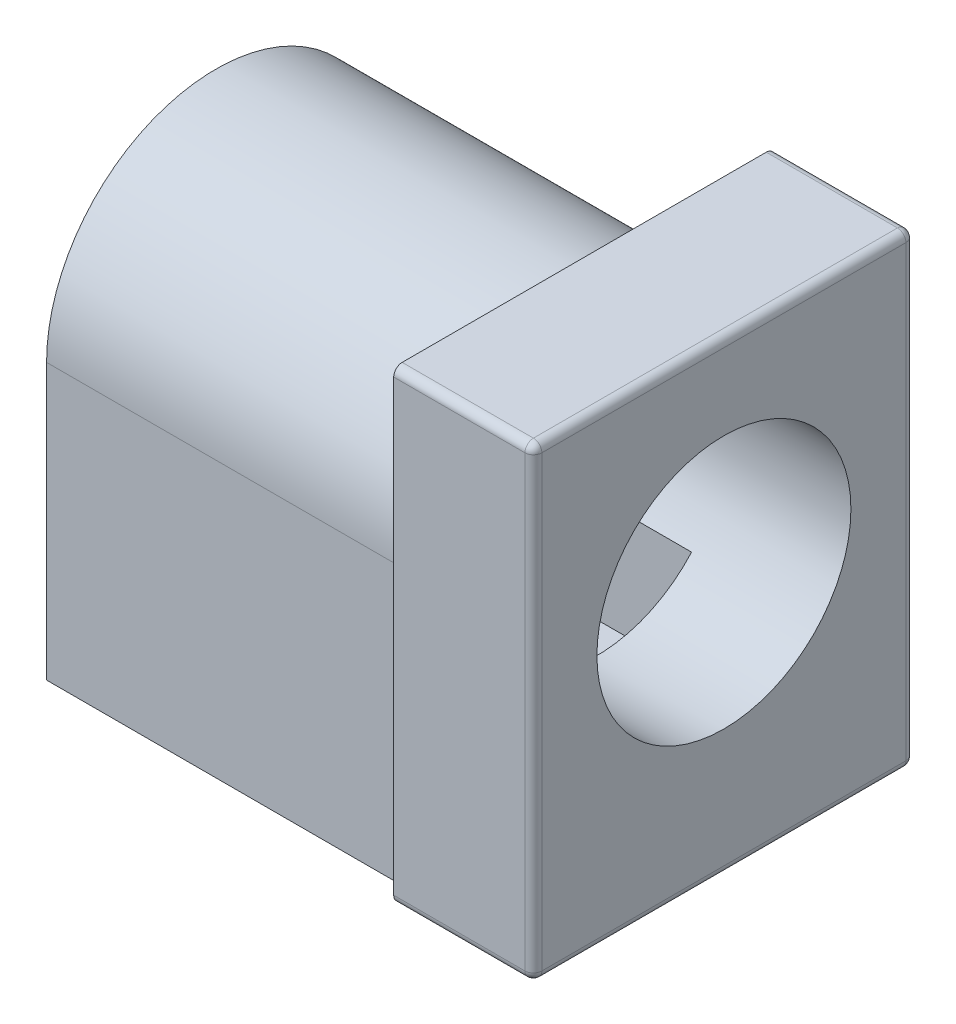
ISO-10303-21;
HEADER;
FILE_DESCRIPTION(('STEP AP214'),'2;1');
FILE_NAME('part.step','',(''),(''),'','','');
FILE_SCHEMA(('AUTOMOTIVE_DESIGN { 1 0 10303 214 1 1 1 1 }'));
ENDSEC;
DATA;
#1=APPLICATION_CONTEXT('core data for automotive mechanical design processes');
#2=APPLICATION_PROTOCOL_DEFINITION('international standard','automotive_design',2000,#1);
#3=PRODUCT_CONTEXT('',#1,'mechanical');
#4=PRODUCT('Part','Part','',(#3));
#5=PRODUCT_RELATED_PRODUCT_CATEGORY('part','',(#4));
#6=PRODUCT_DEFINITION_FORMATION('','',#4);
#7=PRODUCT_DEFINITION_CONTEXT('part definition',#1,'design');
#8=PRODUCT_DEFINITION('design','',#6,#7);
#9=PRODUCT_DEFINITION_SHAPE('','',#8);
#10=(LENGTH_UNIT() NAMED_UNIT(*) SI_UNIT(.MILLI.,.METRE.));
#11=(NAMED_UNIT(*) PLANE_ANGLE_UNIT() SI_UNIT($,.RADIAN.));
#12=(NAMED_UNIT(*) SI_UNIT($,.STERADIAN.) SOLID_ANGLE_UNIT());
#13=UNCERTAINTY_MEASURE_WITH_UNIT(LENGTH_MEASURE(1.E-05),#10,'distance_accuracy_value','');
#14=(GEOMETRIC_REPRESENTATION_CONTEXT(3) GLOBAL_UNCERTAINTY_ASSIGNED_CONTEXT((#13)) GLOBAL_UNIT_ASSIGNED_CONTEXT((#10,
#11,#12)) REPRESENTATION_CONTEXT('',''));
#15=CARTESIAN_POINT('',(0.,0.,0.));
#16=DIRECTION('',(0.,0.,1.));
#17=DIRECTION('',(1.,0.,0.));
#18=AXIS2_PLACEMENT_3D('',#15,#16,#17);
#19=CARTESIAN_POINT('',(12.,0.,0.));
#20=DIRECTION('',(0.,0.,-1.));
#21=DIRECTION('',(-1.,0.,0.));
#22=AXIS2_PLACEMENT_3D('',#19,#20,#21);
#23=PLANE('',#22);
#24=DIRECTION('',(0.,-1.,0.));
#25=VECTOR('',#24,1.);
#26=CARTESIAN_POINT('',(8.7,0.,0.));
#27=LINE('',#26,#25);
#28=CARTESIAN_POINT('',(8.7,10.8,0.));
#29=VERTEX_POINT('',#28);
#30=CARTESIAN_POINT('',(8.7,0.2,0.));
#31=VERTEX_POINT('',#30);
#32=EDGE_CURVE('E296',#29,#31,#27,.T.);
#33=ORIENTED_EDGE('',*,*,#32,.T.);
#34=DIRECTION('',(-1.,0.,0.));
#35=VECTOR('',#34,1.);
#36=CARTESIAN_POINT('',(12.,0.2,0.));
#37=LINE('',#36,#35);
#38=CARTESIAN_POINT('',(11.8,0.2,0.));
#39=VERTEX_POINT('',#38);
#40=EDGE_CURVE('E360',#31,#39,#37,.F.);
#41=ORIENTED_EDGE('',*,*,#40,.T.);
#42=DIRECTION('',(0.,-1.,0.));
#43=VECTOR('',#42,1.);
#44=CARTESIAN_POINT('',(11.8,0.,0.));
#45=LINE('',#44,#43);
#46=CARTESIAN_POINT('',(11.8,10.8,0.));
#47=VERTEX_POINT('',#46);
#48=EDGE_CURVE('E358',#39,#47,#45,.F.);
#49=ORIENTED_EDGE('',*,*,#48,.T.);
#50=DIRECTION('',(-1.,0.,0.));
#51=VECTOR('',#50,1.);
#52=CARTESIAN_POINT('',(12.,10.8,0.));
#53=LINE('',#52,#51);
#54=EDGE_CURVE('E356',#47,#29,#53,.T.);
#55=ORIENTED_EDGE('',*,*,#54,.T.);
#56=EDGE_LOOP('',(#33,#41,#49,#55));
#57=FACE_BOUND('',#56,.T.);
#58=ADVANCED_FACE('F35',(#57),#23,.F.);
#59=CARTESIAN_POINT('',(12.,0.,0.));
#60=DIRECTION('',(0.,1.,0.));
#61=DIRECTION('',(0.,0.,1.));
#62=AXIS2_PLACEMENT_3D('',#59,#60,#61);
#63=PLANE('',#62);
#64=DIRECTION('',(0.,0.,1.));
#65=VECTOR('',#64,1.);
#66=CARTESIAN_POINT('',(5.25,0.,-3.));
#67=LINE('',#66,#65);
#68=CARTESIAN_POINT('',(5.25,0.,-6.));
#69=VERTEX_POINT('',#68);
#70=CARTESIAN_POINT('',(5.25,0.,-3.));
#71=VERTEX_POINT('',#70);
#72=EDGE_CURVE('E275',#69,#71,#67,.T.);
#73=ORIENTED_EDGE('',*,*,#72,.F.);
#74=DIRECTION('',(1.,0.,0.));
#75=VECTOR('',#74,1.);
#76=CARTESIAN_POINT('',(4.75,0.,-6.));
#77=LINE('',#76,#75);
#78=CARTESIAN_POINT('',(4.75,0.,-6.));
#79=VERTEX_POINT('',#78);
#80=EDGE_CURVE('E278',#79,#69,#77,.T.);
#81=ORIENTED_EDGE('',*,*,#80,.F.);
#82=DIRECTION('',(0.,0.,-1.));
#83=VECTOR('',#82,1.);
#84=CARTESIAN_POINT('',(4.75,0.,-3.));
#85=LINE('',#84,#83);
#86=CARTESIAN_POINT('',(4.75,0.,-3.));
#87=VERTEX_POINT('',#86);
#88=EDGE_CURVE('E281',#87,#79,#85,.T.);
#89=ORIENTED_EDGE('',*,*,#88,.F.);
#90=DIRECTION('',(-1.,0.,0.));
#91=VECTOR('',#90,1.);
#92=CARTESIAN_POINT('',(4.75,0.,-3.));
#93=LINE('',#92,#91);
#94=EDGE_CURVE('E271',#71,#87,#93,.T.);
#95=ORIENTED_EDGE('',*,*,#94,.F.);
#96=EDGE_LOOP('',(#73,#81,#89,#95));
#97=FACE_BOUND('',#96,.T.);
#98=DIRECTION('',(0.,0.,-1.));
#99=VECTOR('',#98,1.);
#100=CARTESIAN_POINT('',(11.8,0.,0.));
#101=LINE('',#100,#99);
#102=CARTESIAN_POINT('',(11.8,0.,-8.8));
#103=VERTEX_POINT('',#102);
#104=CARTESIAN_POINT('',(11.8,0.,-0.2));
#105=VERTEX_POINT('',#104);
#106=EDGE_CURVE('E343',#103,#105,#101,.F.);
#107=ORIENTED_EDGE('',*,*,#106,.T.);
#108=DIRECTION('',(-1.,0.,0.));
#109=VECTOR('',#108,1.);
#110=CARTESIAN_POINT('',(12.,0.,-0.2));
#111=LINE('',#110,#109);
#112=CARTESIAN_POINT('',(8.7,0.,-0.2));
#113=VERTEX_POINT('',#112);
#114=EDGE_CURVE('E345',#105,#113,#111,.T.);
#115=ORIENTED_EDGE('',*,*,#114,.T.);
#116=DIRECTION('',(0.,0.,-1.));
#117=VECTOR('',#116,1.);
#118=CARTESIAN_POINT('',(8.7,0.,0.));
#119=LINE('',#118,#117);
#120=CARTESIAN_POINT('',(8.7,0.,-0.499999999999999));
#121=VERTEX_POINT('',#120);
#122=EDGE_CURVE('E310',#113,#121,#119,.T.);
#123=ORIENTED_EDGE('',*,*,#122,.T.);
#124=DIRECTION('',(1.,0.,0.));
#125=VECTOR('',#124,1.);
#126=CARTESIAN_POINT('',(-23.2513440471728,0.,-0.499999999999997));
#127=LINE('',#126,#125);
#128=CARTESIAN_POINT('',(0.,0.,-0.499999999999997));
#129=VERTEX_POINT('',#128);
#130=EDGE_CURVE('E314',#129,#121,#127,.T.);
#131=ORIENTED_EDGE('',*,*,#130,.F.);
#132=DIRECTION('',(0.,0.,-1.));
#133=VECTOR('',#132,1.);
#134=CARTESIAN_POINT('',(0.,0.,0.));
#135=LINE('',#134,#133);
#136=CARTESIAN_POINT('',(0.,0.,-8.5));
#137=VERTEX_POINT('',#136);
#138=EDGE_CURVE('E305',#129,#137,#135,.T.);
#139=ORIENTED_EDGE('',*,*,#138,.T.);
#140=DIRECTION('',(1.,0.,0.));
#141=VECTOR('',#140,1.);
#142=CARTESIAN_POINT('',(-23.2513440471728,0.,-8.5));
#143=LINE('',#142,#141);
#144=CARTESIAN_POINT('',(8.7,0.,-8.5));
#145=VERTEX_POINT('',#144);
#146=EDGE_CURVE('E323',#137,#145,#143,.T.);
#147=ORIENTED_EDGE('',*,*,#146,.T.);
#148=CARTESIAN_POINT('',(8.7,0.,-8.8));
#149=VERTEX_POINT('',#148);
#150=EDGE_CURVE('E337',#145,#149,#119,.T.);
#151=ORIENTED_EDGE('',*,*,#150,.T.);
#152=DIRECTION('',(-1.,0.,0.));
#153=VECTOR('',#152,1.);
#154=CARTESIAN_POINT('',(12.,0.,-8.8));
#155=LINE('',#154,#153);
#156=EDGE_CURVE('E341',#149,#103,#155,.F.);
#157=ORIENTED_EDGE('',*,*,#156,.T.);
#158=EDGE_LOOP('',(#107,#115,#123,#131,#139,#147,#151,#157));
#159=FACE_BOUND('',#158,.T.);
#160=ADVANCED_FACE('F429',(#97,#159),#63,.F.);
#161=CARTESIAN_POINT('',(12.,0.,-9.));
#162=DIRECTION('',(0.,0.,1.));
#163=DIRECTION('',(1.,0.,0.));
#164=AXIS2_PLACEMENT_3D('',#161,#162,#163);
#165=PLANE('',#164);
#166=DIRECTION('',(0.,1.,0.));
#167=VECTOR('',#166,1.);
#168=CARTESIAN_POINT('',(11.8,0.,-9.));
#169=LINE('',#168,#167);
#170=CARTESIAN_POINT('',(11.8,10.8,-9.));
#171=VERTEX_POINT('',#170);
#172=CARTESIAN_POINT('',(11.8,0.2,-9.));
#173=VERTEX_POINT('',#172);
#174=EDGE_CURVE('E373',#171,#173,#169,.F.);
#175=ORIENTED_EDGE('',*,*,#174,.T.);
#176=DIRECTION('',(-1.,0.,0.));
#177=VECTOR('',#176,1.);
#178=CARTESIAN_POINT('',(12.,0.2,-9.));
#179=LINE('',#178,#177);
#180=CARTESIAN_POINT('',(8.7,0.2,-9.));
#181=VERTEX_POINT('',#180);
#182=EDGE_CURVE('E375',#173,#181,#179,.T.);
#183=ORIENTED_EDGE('',*,*,#182,.T.);
#184=DIRECTION('',(0.,1.,0.));
#185=VECTOR('',#184,1.);
#186=CARTESIAN_POINT('',(8.7,0.,-9.));
#187=LINE('',#186,#185);
#188=CARTESIAN_POINT('',(8.7,10.8,-9.));
#189=VERTEX_POINT('',#188);
#190=EDGE_CURVE('E334',#181,#189,#187,.T.);
#191=ORIENTED_EDGE('',*,*,#190,.T.);
#192=DIRECTION('',(-1.,0.,0.));
#193=VECTOR('',#192,1.);
#194=CARTESIAN_POINT('',(12.,10.8,-9.));
#195=LINE('',#194,#193);
#196=EDGE_CURVE('E371',#189,#171,#195,.F.);
#197=ORIENTED_EDGE('',*,*,#196,.T.);
#198=EDGE_LOOP('',(#175,#183,#191,#197));
#199=FACE_BOUND('',#198,.T.);
#200=ADVANCED_FACE('F451',(#199),#165,.F.);
#201=CARTESIAN_POINT('',(12.,11.,0.));
#202=DIRECTION('',(0.,-1.,0.));
#203=DIRECTION('',(0.,0.,-1.));
#204=AXIS2_PLACEMENT_3D('',#201,#202,#203);
#205=PLANE('',#204);
#206=DIRECTION('',(0.,0.,1.));
#207=VECTOR('',#206,1.);
#208=CARTESIAN_POINT('',(11.8,11.,0.));
#209=LINE('',#208,#207);
#210=CARTESIAN_POINT('',(11.8,11.,-0.2));
#211=VERTEX_POINT('',#210);
#212=CARTESIAN_POINT('',(11.8,11.,-8.8));
#213=VERTEX_POINT('',#212);
#214=EDGE_CURVE('E58',#211,#213,#209,.F.);
#215=ORIENTED_EDGE('',*,*,#214,.T.);
#216=DIRECTION('',(-1.,0.,0.));
#217=VECTOR('',#216,1.);
#218=CARTESIAN_POINT('',(12.,11.,-8.8));
#219=LINE('',#218,#217);
#220=CARTESIAN_POINT('',(8.7,11.,-8.8));
#221=VERTEX_POINT('',#220);
#222=EDGE_CURVE('E380',#213,#221,#219,.T.);
#223=ORIENTED_EDGE('',*,*,#222,.T.);
#224=DIRECTION('',(0.,0.,1.));
#225=VECTOR('',#224,1.);
#226=CARTESIAN_POINT('',(8.7,11.,0.));
#227=LINE('',#226,#225);
#228=CARTESIAN_POINT('',(8.7,11.,-0.2));
#229=VERTEX_POINT('',#228);
#230=EDGE_CURVE('E331',#221,#229,#227,.T.);
#231=ORIENTED_EDGE('',*,*,#230,.T.);
#232=DIRECTION('',(-1.,0.,0.));
#233=VECTOR('',#232,1.);
#234=CARTESIAN_POINT('',(12.,11.,-0.2));
#235=LINE('',#234,#233);
#236=EDGE_CURVE('E377',#229,#211,#235,.F.);
#237=ORIENTED_EDGE('',*,*,#236,.T.);
#238=EDGE_LOOP('',(#215,#223,#231,#237));
#239=FACE_BOUND('',#238,.T.);
#240=ADVANCED_FACE('F746',(#239),#205,.F.);
#241=CARTESIAN_POINT('',(0.,0.,0.));
#242=DIRECTION('',(-1.,0.,0.));
#243=DIRECTION('',(0.,0.,1.));
#244=AXIS2_PLACEMENT_3D('',#241,#242,#243);
#245=PLANE('',#244);
#246=DIRECTION('',(0.,-1.,0.));
#247=VECTOR('',#246,1.);
#248=CARTESIAN_POINT('',(0.,4.,-6.73606797749979));
#249=LINE('',#248,#247);
#250=CARTESIAN_POINT('',(0.,3.5,-6.73606797749979));
#251=VERTEX_POINT('',#250);
#252=CARTESIAN_POINT('',(0.,1.5,-6.73606797749979));
#253=VERTEX_POINT('',#252);
#254=EDGE_CURVE('E211',#251,#253,#249,.T.);
#255=ORIENTED_EDGE('',*,*,#254,.F.);
#256=DIRECTION('',(0.,0.,-1.));
#257=VECTOR('',#256,1.);
#258=CARTESIAN_POINT('',(0.,3.5,0.001000000000001));
#259=LINE('',#258,#257);
#260=CARTESIAN_POINT('',(0.,3.5,-8.5));
#261=VERTEX_POINT('',#260);
#262=EDGE_CURVE('E268',#251,#261,#259,.T.);
#263=ORIENTED_EDGE('',*,*,#262,.T.);
#264=DIRECTION('',(0.,1.,0.));
#265=VECTOR('',#264,1.);
#266=CARTESIAN_POINT('',(0.,6.5,-8.5));
#267=LINE('',#266,#265);
#268=EDGE_CURVE('E303',#137,#261,#267,.T.);
#269=ORIENTED_EDGE('',*,*,#268,.F.);
#270=ORIENTED_EDGE('',*,*,#138,.F.);
#271=DIRECTION('',(0.,-1.,0.));
#272=VECTOR('',#271,1.);
#273=CARTESIAN_POINT('',(0.,6.5,-0.500000000000006));
#274=LINE('',#273,#272);
#275=CARTESIAN_POINT('',(0.,6.5,-0.500000000000006));
#276=VERTEX_POINT('',#275);
#277=EDGE_CURVE('E302',#276,#129,#274,.T.);
#278=ORIENTED_EDGE('',*,*,#277,.F.);
#279=CARTESIAN_POINT('',(0.,6.5,-4.5));
#280=DIRECTION('',(-1.,0.,0.));
#281=DIRECTION('',(0.,0.,1.));
#282=AXIS2_PLACEMENT_3D('',#279,#280,#281);
#283=CIRCLE('',#282,4.);
#284=CARTESIAN_POINT('',(0.,6.5,-8.5));
#285=VERTEX_POINT('',#284);
#286=EDGE_CURVE('E299',#285,#276,#283,.F.);
#287=ORIENTED_EDGE('',*,*,#286,.F.);
#288=CARTESIAN_POINT('',(0.,4.,-8.5));
#289=VERTEX_POINT('',#288);
#290=EDGE_CURVE('E326',#289,#285,#267,.T.);
#291=ORIENTED_EDGE('',*,*,#290,.F.);
#292=DIRECTION('',(0.,0.,-1.));
#293=VECTOR('',#292,1.);
#294=CARTESIAN_POINT('',(0.,4.,0.001000000000001));
#295=LINE('',#294,#293);
#296=CARTESIAN_POINT('',(0.,4.,-6.73606797749979));
#297=VERTEX_POINT('',#296);
#298=EDGE_CURVE('E266',#297,#289,#295,.T.);
#299=ORIENTED_EDGE('',*,*,#298,.F.);
#300=CARTESIAN_POINT('',(0.,6.,-4.5));
#301=DIRECTION('',(1.,0.,0.));
#302=DIRECTION('',(0.,0.,-1.));
#303=AXIS2_PLACEMENT_3D('',#300,#301,#302);
#304=CIRCLE('',#303,3.);
#305=CARTESIAN_POINT('',(0.,4.,-2.26393202250021));
#306=VERTEX_POINT('',#305);
#307=EDGE_CURVE('E293',#297,#306,#304,.T.);
#308=ORIENTED_EDGE('',*,*,#307,.T.);
#309=DIRECTION('',(0.,1.,0.));
#310=VECTOR('',#309,1.);
#311=CARTESIAN_POINT('',(0.,4.,-2.26393202250021));
#312=LINE('',#311,#310);
#313=CARTESIAN_POINT('',(0.,1.5,-2.26393202250021));
#314=VERTEX_POINT('',#313);
#315=EDGE_CURVE('E227',#314,#306,#312,.T.);
#316=ORIENTED_EDGE('',*,*,#315,.F.);
#317=DIRECTION('',(0.,0.,1.));
#318=VECTOR('',#317,1.);
#319=CARTESIAN_POINT('',(0.,1.5,-6.73606797749979));
#320=LINE('',#319,#318);
#321=EDGE_CURVE('E229',#253,#314,#320,.T.);
#322=ORIENTED_EDGE('',*,*,#321,.F.);
#323=EDGE_LOOP('',(#255,#263,#269,#270,#278,#287,#291,#299,#308,#316,#322));
#324=FACE_BOUND('',#323,.T.);
#325=ADVANCED_FACE('F530',(#324),#245,.T.);
#326=CARTESIAN_POINT('',(12.,0.,0.));
#327=DIRECTION('',(-1.,0.,0.));
#328=DIRECTION('',(0.,0.,1.));
#329=AXIS2_PLACEMENT_3D('',#326,#327,#328);
#330=PLANE('',#329);
#331=DIRECTION('',(0.,0.,1.));
#332=VECTOR('',#331,1.);
#333=CARTESIAN_POINT('',(12.,10.8,0.));
#334=LINE('',#333,#332);
#335=CARTESIAN_POINT('',(12.,10.8,-8.8));
#336=VERTEX_POINT('',#335);
#337=CARTESIAN_POINT('',(12.,10.8,-0.2));
#338=VERTEX_POINT('',#337);
#339=EDGE_CURVE('E364',#336,#338,#334,.T.);
#340=ORIENTED_EDGE('',*,*,#339,.T.);
#341=DIRECTION('',(0.,-1.,0.));
#342=VECTOR('',#341,1.);
#343=CARTESIAN_POINT('',(12.,0.,-0.2));
#344=LINE('',#343,#342);
#345=CARTESIAN_POINT('',(12.,0.2,-0.2));
#346=VERTEX_POINT('',#345);
#347=EDGE_CURVE('E368',#338,#346,#344,.T.);
#348=ORIENTED_EDGE('',*,*,#347,.T.);
#349=DIRECTION('',(0.,0.,-1.));
#350=VECTOR('',#349,1.);
#351=CARTESIAN_POINT('',(12.,0.2,0.));
#352=LINE('',#351,#350);
#353=CARTESIAN_POINT('',(12.,0.2,-8.8));
#354=VERTEX_POINT('',#353);
#355=EDGE_CURVE('E366',#346,#354,#352,.T.);
#356=ORIENTED_EDGE('',*,*,#355,.T.);
#357=DIRECTION('',(0.,1.,0.));
#358=VECTOR('',#357,1.);
#359=CARTESIAN_POINT('',(12.,0.,-8.8));
#360=LINE('',#359,#358);
#361=EDGE_CURVE('E362',#354,#336,#360,.T.);
#362=ORIENTED_EDGE('',*,*,#361,.T.);
#363=EDGE_LOOP('',(#340,#348,#356,#362));
#364=FACE_BOUND('',#363,.T.);
#365=CARTESIAN_POINT('',(12.,6.,-4.5));
#366=DIRECTION('',(1.,0.,0.));
#367=DIRECTION('',(0.,0.,-1.));
#368=AXIS2_PLACEMENT_3D('',#365,#366,#367);
#369=CIRCLE('',#368,3.);
#370=CARTESIAN_POINT('',(12.,6.,-7.5));
#371=VERTEX_POINT('',#370);
#372=EDGE_CURVE('E292',#371,#371,#369,.T.);
#373=ORIENTED_EDGE('',*,*,#372,.F.);
#374=EDGE_LOOP('',(#373));
#375=FACE_BOUND('',#374,.T.);
#376=ADVANCED_FACE('F728',(#364,#375),#330,.F.);
#377=CARTESIAN_POINT('',(-23.2513440471728,6.5,-8.5));
#378=DIRECTION('',(0.,0.,-1.));
#379=DIRECTION('',(0.,1.,0.));
#380=AXIS2_PLACEMENT_3D('',#377,#378,#379);
#381=PLANE('',#380);
#382=DIRECTION('',(1.,0.,0.));
#383=VECTOR('',#382,1.);
#384=CARTESIAN_POINT('',(3.,4.,-8.5));
#385=LINE('',#384,#383);
#386=CARTESIAN_POINT('',(3.,4.,-8.5));
#387=VERTEX_POINT('',#386);
#388=EDGE_CURVE('E259',#289,#387,#385,.T.);
#389=ORIENTED_EDGE('',*,*,#388,.F.);
#390=ORIENTED_EDGE('',*,*,#290,.T.);
#391=DIRECTION('',(1.,0.,0.));
#392=VECTOR('',#391,1.);
#393=CARTESIAN_POINT('',(-23.2513440471728,6.5,-8.5));
#394=LINE('',#393,#392);
#395=CARTESIAN_POINT('',(8.7,6.5,-8.5));
#396=VERTEX_POINT('',#395);
#397=EDGE_CURVE('E320',#285,#396,#394,.T.);
#398=ORIENTED_EDGE('',*,*,#397,.T.);
#399=DIRECTION('',(0.,1.,0.));
#400=VECTOR('',#399,1.);
#401=CARTESIAN_POINT('',(8.7,6.5,-8.5));
#402=LINE('',#401,#400);
#403=EDGE_CURVE('E312',#145,#396,#402,.T.);
#404=ORIENTED_EDGE('',*,*,#403,.F.);
#405=ORIENTED_EDGE('',*,*,#146,.F.);
#406=ORIENTED_EDGE('',*,*,#268,.T.);
#407=DIRECTION('',(-1.,0.,0.));
#408=VECTOR('',#407,1.);
#409=CARTESIAN_POINT('',(3.,3.5,-8.5));
#410=LINE('',#409,#408);
#411=CARTESIAN_POINT('',(3.,3.5,-8.5));
#412=VERTEX_POINT('',#411);
#413=EDGE_CURVE('E256',#412,#261,#410,.T.);
#414=ORIENTED_EDGE('',*,*,#413,.F.);
#415=DIRECTION('',(0.,-1.,0.));
#416=VECTOR('',#415,1.);
#417=CARTESIAN_POINT('',(3.,4.,-8.5));
#418=LINE('',#417,#416);
#419=EDGE_CURVE('E253',#387,#412,#418,.T.);
#420=ORIENTED_EDGE('',*,*,#419,.F.);
#421=EDGE_LOOP('',(#389,#390,#398,#404,#405,#406,#414,#420));
#422=FACE_BOUND('',#421,.T.);
#423=ADVANCED_FACE('F527',(#422),#381,.T.);
#424=CARTESIAN_POINT('',(-23.2513440471728,6.5,-4.5));
#425=DIRECTION('',(1.,0.,0.));
#426=DIRECTION('',(0.,0.,-1.));
#427=AXIS2_PLACEMENT_3D('',#424,#425,#426);
#428=CYLINDRICAL_SURFACE('',#427,4.);
#429=ORIENTED_EDGE('',*,*,#397,.F.);
#430=ORIENTED_EDGE('',*,*,#286,.T.);
#431=DIRECTION('',(1.,0.,0.));
#432=VECTOR('',#431,1.);
#433=CARTESIAN_POINT('',(-23.2513440471728,6.5,-0.500000000000006));
#434=LINE('',#433,#432);
#435=CARTESIAN_POINT('',(8.7,6.5,-0.500000000000006));
#436=VERTEX_POINT('',#435);
#437=EDGE_CURVE('E317',#276,#436,#434,.T.);
#438=ORIENTED_EDGE('',*,*,#437,.T.);
#439=CARTESIAN_POINT('',(8.7,6.5,-4.5));
#440=DIRECTION('',(-1.,0.,0.));
#441=DIRECTION('',(0.,0.,1.));
#442=AXIS2_PLACEMENT_3D('',#439,#440,#441);
#443=CIRCLE('',#442,4.);
#444=EDGE_CURVE('E309',#396,#436,#443,.F.);
#445=ORIENTED_EDGE('',*,*,#444,.F.);
#446=EDGE_LOOP('',(#429,#430,#438,#445));
#447=FACE_BOUND('',#446,.T.);
#448=ADVANCED_FACE('F712',(#447),#428,.T.);
#449=CARTESIAN_POINT('',(-23.2513440471728,6.5,-0.500000000000006));
#450=DIRECTION('',(0.,0.,1.));
#451=DIRECTION('',(0.,-1.,0.));
#452=AXIS2_PLACEMENT_3D('',#449,#450,#451);
#453=PLANE('',#452);
#454=ORIENTED_EDGE('',*,*,#437,.F.);
#455=ORIENTED_EDGE('',*,*,#277,.T.);
#456=ORIENTED_EDGE('',*,*,#130,.T.);
#457=DIRECTION('',(0.,-1.,0.));
#458=VECTOR('',#457,1.);
#459=CARTESIAN_POINT('',(8.7,6.5,-0.500000000000006));
#460=LINE('',#459,#458);
#461=EDGE_CURVE('E306',#436,#121,#460,.T.);
#462=ORIENTED_EDGE('',*,*,#461,.F.);
#463=EDGE_LOOP('',(#454,#455,#456,#462));
#464=FACE_BOUND('',#463,.T.);
#465=ADVANCED_FACE('F703',(#464),#453,.T.);
#466=CARTESIAN_POINT('',(8.7,0.,0.));
#467=DIRECTION('',(-1.,0.,0.));
#468=DIRECTION('',(0.,0.,1.));
#469=AXIS2_PLACEMENT_3D('',#466,#467,#468);
#470=PLANE('',#469);
#471=ORIENTED_EDGE('',*,*,#122,.F.);
#472=CARTESIAN_POINT('',(8.7,0.2,-0.2));
#473=DIRECTION('',(-1.,0.,0.));
#474=DIRECTION('',(0.,0.,1.));
#475=AXIS2_PLACEMENT_3D('',#472,#473,#474);
#476=CIRCLE('',#475,0.2);
#477=EDGE_CURVE('E354',#113,#31,#476,.T.);
#478=ORIENTED_EDGE('',*,*,#477,.T.);
#479=ORIENTED_EDGE('',*,*,#32,.F.);
#480=CARTESIAN_POINT('',(8.7,10.8,-0.2));
#481=DIRECTION('',(-1.,0.,0.));
#482=DIRECTION('',(0.,0.,1.));
#483=AXIS2_PLACEMENT_3D('',#480,#481,#482);
#484=CIRCLE('',#483,0.2);
#485=EDGE_CURVE('E348',#29,#229,#484,.T.);
#486=ORIENTED_EDGE('',*,*,#485,.T.);
#487=ORIENTED_EDGE('',*,*,#230,.F.);
#488=CARTESIAN_POINT('',(8.7,10.8,-8.8));
#489=DIRECTION('',(-1.,0.,0.));
#490=DIRECTION('',(0.,0.,1.));
#491=AXIS2_PLACEMENT_3D('',#488,#489,#490);
#492=CIRCLE('',#491,0.2);
#493=EDGE_CURVE('E350',#221,#189,#492,.T.);
#494=ORIENTED_EDGE('',*,*,#493,.T.);
#495=ORIENTED_EDGE('',*,*,#190,.F.);
#496=CARTESIAN_POINT('',(8.7,0.2,-8.8));
#497=DIRECTION('',(-1.,0.,0.));
#498=DIRECTION('',(0.,0.,1.));
#499=AXIS2_PLACEMENT_3D('',#496,#497,#498);
#500=CIRCLE('',#499,0.2);
#501=EDGE_CURVE('E352',#181,#149,#500,.T.);
#502=ORIENTED_EDGE('',*,*,#501,.T.);
#503=ORIENTED_EDGE('',*,*,#150,.F.);
#504=ORIENTED_EDGE('',*,*,#403,.T.);
#505=ORIENTED_EDGE('',*,*,#444,.T.);
#506=ORIENTED_EDGE('',*,*,#461,.T.);
#507=EDGE_LOOP('',(#471,#478,#479,#486,#487,#494,#495,#502,#503,#504,#505,#506));
#508=FACE_BOUND('',#507,.T.);
#509=ADVANCED_FACE('F520',(#508),#470,.T.);
#510=CARTESIAN_POINT('',(0.,6.,-4.5));
#511=DIRECTION('',(1.,0.,0.));
#512=DIRECTION('',(0.,0.,-1.));
#513=AXIS2_PLACEMENT_3D('',#510,#511,#512);
#514=CYLINDRICAL_SURFACE('',#513,3.);
#515=DIRECTION('',(1.,0.,0.));
#516=VECTOR('',#515,1.);
#517=CARTESIAN_POINT('',(0.,4.,-6.73606797749979));
#518=LINE('',#517,#516);
#519=CARTESIAN_POINT('',(3.,4.,-6.73606797749979));
#520=VERTEX_POINT('',#519);
#521=EDGE_CURVE('E251',#520,#297,#518,.F.);
#522=ORIENTED_EDGE('',*,*,#521,.F.);
#523=DIRECTION('',(-1.,0.,0.));
#524=VECTOR('',#523,1.);
#525=CARTESIAN_POINT('',(9.,4.,-6.73606797749979));
#526=LINE('',#525,#524);
#527=CARTESIAN_POINT('',(9.,4.,-6.73606797749979));
#528=VERTEX_POINT('',#527);
#529=EDGE_CURVE('E235',#528,#520,#526,.T.);
#530=ORIENTED_EDGE('',*,*,#529,.F.);
#531=CARTESIAN_POINT('',(9.,6.,-4.5));
#532=DIRECTION('',(-1.,0.,0.));
#533=DIRECTION('',(0.,0.,1.));
#534=AXIS2_PLACEMENT_3D('',#531,#532,#533);
#535=CIRCLE('',#534,3.);
#536=CARTESIAN_POINT('',(9.,4.,-2.26393202250021));
#537=VERTEX_POINT('',#536);
#538=EDGE_CURVE('E11',#537,#528,#535,.F.);
#539=ORIENTED_EDGE('',*,*,#538,.F.);
#540=DIRECTION('',(-1.,0.,0.));
#541=VECTOR('',#540,1.);
#542=CARTESIAN_POINT('',(9.,4.,-2.26393202250021));
#543=LINE('',#542,#541);
#544=EDGE_CURVE('E238',#537,#306,#543,.T.);
#545=ORIENTED_EDGE('',*,*,#544,.T.);
#546=ORIENTED_EDGE('',*,*,#307,.F.);
#547=EDGE_LOOP('',(#522,#530,#539,#545,#546));
#548=FACE_BOUND('',#547,.T.);
#549=ORIENTED_EDGE('',*,*,#372,.T.);
#550=EDGE_LOOP('',(#549));
#551=FACE_BOUND('',#550,.T.);
#552=ADVANCED_FACE('F443',(#548,#551),#514,.F.);
#553=CARTESIAN_POINT('',(4.75,11.001,-6.));
#554=DIRECTION('',(0.,0.,-1.));
#555=DIRECTION('',(-1.,0.,0.));
#556=AXIS2_PLACEMENT_3D('',#553,#554,#555);
#557=PLANE('',#556);
#558=DIRECTION('',(0.,-1.,0.));
#559=VECTOR('',#558,1.);
#560=CARTESIAN_POINT('',(5.25,11.001,-6.));
#561=LINE('',#560,#559);
#562=CARTESIAN_POINT('',(5.25,1.5,-6.));
#563=VERTEX_POINT('',#562);
#564=EDGE_CURVE('E274',#563,#69,#561,.T.);
#565=ORIENTED_EDGE('',*,*,#564,.F.);
#566=DIRECTION('',(-1.,0.,0.));
#567=VECTOR('',#566,1.);
#568=CARTESIAN_POINT('',(4.75,1.5,-6.));
#569=LINE('',#568,#567);
#570=CARTESIAN_POINT('',(4.75,1.5,-6.));
#571=VERTEX_POINT('',#570);
#572=EDGE_CURVE('E248',#563,#571,#569,.T.);
#573=ORIENTED_EDGE('',*,*,#572,.T.);
#574=DIRECTION('',(0.,-1.,0.));
#575=VECTOR('',#574,1.);
#576=CARTESIAN_POINT('',(4.75,11.001,-6.));
#577=LINE('',#576,#575);
#578=EDGE_CURVE('E287',#571,#79,#577,.T.);
#579=ORIENTED_EDGE('',*,*,#578,.T.);
#580=ORIENTED_EDGE('',*,*,#80,.T.);
#581=EDGE_LOOP('',(#565,#573,#579,#580));
#582=FACE_BOUND('',#581,.T.);
#583=ADVANCED_FACE('F433',(#582),#557,.F.);
#584=CARTESIAN_POINT('',(5.25,11.001,-3.));
#585=DIRECTION('',(1.,0.,0.));
#586=DIRECTION('',(0.,0.,-1.));
#587=AXIS2_PLACEMENT_3D('',#584,#585,#586);
#588=PLANE('',#587);
#589=DIRECTION('',(0.,-1.,0.));
#590=VECTOR('',#589,1.);
#591=CARTESIAN_POINT('',(5.25,11.001,-3.));
#592=LINE('',#591,#590);
#593=CARTESIAN_POINT('',(5.25,1.5,-3.));
#594=VERTEX_POINT('',#593);
#595=EDGE_CURVE('E288',#594,#71,#592,.T.);
#596=ORIENTED_EDGE('',*,*,#595,.F.);
#597=DIRECTION('',(0.,0.,-1.));
#598=VECTOR('',#597,1.);
#599=CARTESIAN_POINT('',(5.25,1.5,-3.));
#600=LINE('',#599,#598);
#601=EDGE_CURVE('E245',#594,#563,#600,.T.);
#602=ORIENTED_EDGE('',*,*,#601,.T.);
#603=ORIENTED_EDGE('',*,*,#564,.T.);
#604=ORIENTED_EDGE('',*,*,#72,.T.);
#605=EDGE_LOOP('',(#596,#602,#603,#604));
#606=FACE_BOUND('',#605,.T.);
#607=ADVANCED_FACE('F435',(#606),#588,.F.);
#608=CARTESIAN_POINT('',(4.75,11.001,-3.));
#609=DIRECTION('',(0.,0.,1.));
#610=DIRECTION('',(1.,0.,0.));
#611=AXIS2_PLACEMENT_3D('',#608,#609,#610);
#612=PLANE('',#611);
#613=DIRECTION('',(0.,-1.,0.));
#614=VECTOR('',#613,1.);
#615=CARTESIAN_POINT('',(4.75,11.001,-3.));
#616=LINE('',#615,#614);
#617=CARTESIAN_POINT('',(4.75,1.5,-3.));
#618=VERTEX_POINT('',#617);
#619=EDGE_CURVE('E285',#618,#87,#616,.T.);
#620=ORIENTED_EDGE('',*,*,#619,.F.);
#621=DIRECTION('',(1.,0.,0.));
#622=VECTOR('',#621,1.);
#623=CARTESIAN_POINT('',(4.75,1.5,-3.));
#624=LINE('',#623,#622);
#625=EDGE_CURVE('E50',#618,#594,#624,.T.);
#626=ORIENTED_EDGE('',*,*,#625,.T.);
#627=ORIENTED_EDGE('',*,*,#595,.T.);
#628=ORIENTED_EDGE('',*,*,#94,.T.);
#629=EDGE_LOOP('',(#620,#626,#627,#628));
#630=FACE_BOUND('',#629,.T.);
#631=ADVANCED_FACE('F422',(#630),#612,.F.);
#632=CARTESIAN_POINT('',(4.75,11.001,-3.));
#633=DIRECTION('',(-1.,0.,0.));
#634=DIRECTION('',(0.,0.,1.));
#635=AXIS2_PLACEMENT_3D('',#632,#633,#634);
#636=PLANE('',#635);
#637=ORIENTED_EDGE('',*,*,#578,.F.);
#638=DIRECTION('',(0.,0.,1.));
#639=VECTOR('',#638,1.);
#640=CARTESIAN_POINT('',(4.75,1.5,-3.));
#641=LINE('',#640,#639);
#642=EDGE_CURVE('E43',#571,#618,#641,.T.);
#643=ORIENTED_EDGE('',*,*,#642,.T.);
#644=ORIENTED_EDGE('',*,*,#619,.T.);
#645=ORIENTED_EDGE('',*,*,#88,.T.);
#646=EDGE_LOOP('',(#637,#643,#644,#645));
#647=FACE_BOUND('',#646,.T.);
#648=ADVANCED_FACE('F420',(#647),#636,.F.);
#649=CARTESIAN_POINT('',(12.,10.8,-8.8));
#650=DIRECTION('',(-1.,0.,0.));
#651=DIRECTION('',(0.,0.,1.));
#652=AXIS2_PLACEMENT_3D('',#649,#650,#651);
#653=CYLINDRICAL_SURFACE('',#652,0.2);
#654=CARTESIAN_POINT('',(11.8,10.8,-8.8));
#655=DIRECTION('',(1.,0.,0.));
#656=DIRECTION('',(0.,0.,-1.));
#657=AXIS2_PLACEMENT_3D('',#654,#655,#656);
#658=CIRCLE('',#657,0.2);
#659=EDGE_CURVE('E284',#171,#213,#658,.T.);
#660=ORIENTED_EDGE('',*,*,#659,.F.);
#661=ORIENTED_EDGE('',*,*,#196,.F.);
#662=ORIENTED_EDGE('',*,*,#493,.F.);
#663=ORIENTED_EDGE('',*,*,#222,.F.);
#664=EDGE_LOOP('',(#660,#661,#662,#663));
#665=FACE_BOUND('',#664,.T.);
#666=ADVANCED_FACE('F37',(#665),#653,.T.);
#667=CARTESIAN_POINT('',(11.8,10.8,-8.8));
#668=DIRECTION('',(0.,0.,1.));
#669=DIRECTION('',(1.,0.,0.));
#670=AXIS2_PLACEMENT_3D('',#667,#668,#669);
#671=SPHERICAL_SURFACE('',#670,0.2);
#672=CARTESIAN_POINT('',(11.8,10.8,-8.8));
#673=DIRECTION('',(0.,1.,0.));
#674=DIRECTION('',(0.,0.,1.));
#675=AXIS2_PLACEMENT_3D('',#672,#673,#674);
#676=CIRCLE('',#675,0.2);
#677=EDGE_CURVE('E408',#171,#336,#676,.F.);
#678=ORIENTED_EDGE('',*,*,#677,.F.);
#679=ORIENTED_EDGE('',*,*,#659,.T.);
#680=CARTESIAN_POINT('',(11.8,10.8,-8.8));
#681=DIRECTION('',(0.,0.,-1.));
#682=DIRECTION('',(-1.,0.,0.));
#683=AXIS2_PLACEMENT_3D('',#680,#681,#682);
#684=CIRCLE('',#683,0.2);
#685=EDGE_CURVE('E411',#336,#213,#684,.F.);
#686=ORIENTED_EDGE('',*,*,#685,.F.);
#687=EDGE_LOOP('',(#678,#679,#686));
#688=FACE_BOUND('',#687,.T.);
#689=ADVANCED_FACE('F494',(#688),#671,.T.);
#690=CARTESIAN_POINT('',(12.,10.8,-0.2));
#691=DIRECTION('',(-1.,0.,0.));
#692=DIRECTION('',(0.,0.,1.));
#693=AXIS2_PLACEMENT_3D('',#690,#691,#692);
#694=CYLINDRICAL_SURFACE('',#693,0.2);
#695=ORIENTED_EDGE('',*,*,#485,.F.);
#696=ORIENTED_EDGE('',*,*,#54,.F.);
#697=CARTESIAN_POINT('',(11.8,10.8,-0.2));
#698=DIRECTION('',(1.,0.,0.));
#699=DIRECTION('',(0.,0.,-1.));
#700=AXIS2_PLACEMENT_3D('',#697,#698,#699);
#701=CIRCLE('',#700,0.2);
#702=EDGE_CURVE('E405',#211,#47,#701,.T.);
#703=ORIENTED_EDGE('',*,*,#702,.F.);
#704=ORIENTED_EDGE('',*,*,#236,.F.);
#705=EDGE_LOOP('',(#695,#696,#703,#704));
#706=FACE_BOUND('',#705,.T.);
#707=ADVANCED_FACE('F491',(#706),#694,.T.);
#708=CARTESIAN_POINT('',(11.8,10.8,0.));
#709=DIRECTION('',(0.,0.,1.));
#710=DIRECTION('',(1.,0.,0.));
#711=AXIS2_PLACEMENT_3D('',#708,#709,#710);
#712=CYLINDRICAL_SURFACE('',#711,0.2);
#713=ORIENTED_EDGE('',*,*,#685,.T.);
#714=ORIENTED_EDGE('',*,*,#214,.F.);
#715=CARTESIAN_POINT('',(11.8,10.8,-0.2));
#716=DIRECTION('',(0.,0.,1.));
#717=DIRECTION('',(1.,0.,0.));
#718=AXIS2_PLACEMENT_3D('',#715,#716,#717);
#719=CIRCLE('',#718,0.2);
#720=EDGE_CURVE('E402',#338,#211,#719,.T.);
#721=ORIENTED_EDGE('',*,*,#720,.F.);
#722=ORIENTED_EDGE('',*,*,#339,.F.);
#723=EDGE_LOOP('',(#713,#714,#721,#722));
#724=FACE_BOUND('',#723,.T.);
#725=ADVANCED_FACE('F487',(#724),#712,.T.);
#726=CARTESIAN_POINT('',(11.8,0.,-8.8));
#727=DIRECTION('',(0.,1.,0.));
#728=DIRECTION('',(0.,0.,1.));
#729=AXIS2_PLACEMENT_3D('',#726,#727,#728);
#730=CYLINDRICAL_SURFACE('',#729,0.2);
#731=ORIENTED_EDGE('',*,*,#677,.T.);
#732=ORIENTED_EDGE('',*,*,#361,.F.);
#733=CARTESIAN_POINT('',(11.8,0.2,-8.8));
#734=DIRECTION('',(0.,-1.,0.));
#735=DIRECTION('',(0.,0.,-1.));
#736=AXIS2_PLACEMENT_3D('',#733,#734,#735);
#737=CIRCLE('',#736,0.2);
#738=EDGE_CURVE('E399',#173,#354,#737,.T.);
#739=ORIENTED_EDGE('',*,*,#738,.F.);
#740=ORIENTED_EDGE('',*,*,#174,.F.);
#741=EDGE_LOOP('',(#731,#732,#739,#740));
#742=FACE_BOUND('',#741,.T.);
#743=ADVANCED_FACE('F483',(#742),#730,.T.);
#744=CARTESIAN_POINT('',(12.,0.2,-8.8));
#745=DIRECTION('',(-1.,0.,0.));
#746=DIRECTION('',(0.,0.,1.));
#747=AXIS2_PLACEMENT_3D('',#744,#745,#746);
#748=CYLINDRICAL_SURFACE('',#747,0.2);
#749=ORIENTED_EDGE('',*,*,#501,.F.);
#750=ORIENTED_EDGE('',*,*,#182,.F.);
#751=CARTESIAN_POINT('',(11.8,0.2,-8.8));
#752=DIRECTION('',(1.,0.,0.));
#753=DIRECTION('',(0.,0.,-1.));
#754=AXIS2_PLACEMENT_3D('',#751,#752,#753);
#755=CIRCLE('',#754,0.2);
#756=EDGE_CURVE('E396',#103,#173,#755,.T.);
#757=ORIENTED_EDGE('',*,*,#756,.F.);
#758=ORIENTED_EDGE('',*,*,#156,.F.);
#759=EDGE_LOOP('',(#749,#750,#757,#758));
#760=FACE_BOUND('',#759,.T.);
#761=ADVANCED_FACE('F479',(#760),#748,.T.);
#762=CARTESIAN_POINT('',(11.8,10.8,-0.2));
#763=DIRECTION('',(0.,0.,1.));
#764=DIRECTION('',(1.,0.,0.));
#765=AXIS2_PLACEMENT_3D('',#762,#763,#764);
#766=SPHERICAL_SURFACE('',#765,0.2);
#767=ORIENTED_EDGE('',*,*,#720,.T.);
#768=ORIENTED_EDGE('',*,*,#702,.T.);
#769=CARTESIAN_POINT('',(11.8,10.8,-0.2));
#770=DIRECTION('',(0.,1.,0.));
#771=DIRECTION('',(0.,0.,1.));
#772=AXIS2_PLACEMENT_3D('',#769,#770,#771);
#773=CIRCLE('',#772,0.2);
#774=EDGE_CURVE('E393',#338,#47,#773,.F.);
#775=ORIENTED_EDGE('',*,*,#774,.F.);
#776=EDGE_LOOP('',(#767,#768,#775));
#777=FACE_BOUND('',#776,.T.);
#778=ADVANCED_FACE('F475',(#777),#766,.T.);
#779=CARTESIAN_POINT('',(11.8,0.2,-8.8));
#780=DIRECTION('',(0.,0.,1.));
#781=DIRECTION('',(1.,0.,0.));
#782=AXIS2_PLACEMENT_3D('',#779,#780,#781);
#783=SPHERICAL_SURFACE('',#782,0.2);
#784=ORIENTED_EDGE('',*,*,#756,.T.);
#785=ORIENTED_EDGE('',*,*,#738,.T.);
#786=CARTESIAN_POINT('',(11.8,0.2,-8.8));
#787=DIRECTION('',(0.,0.,-1.));
#788=DIRECTION('',(-1.,0.,0.));
#789=AXIS2_PLACEMENT_3D('',#786,#787,#788);
#790=CIRCLE('',#789,0.2);
#791=EDGE_CURVE('E390',#103,#354,#790,.F.);
#792=ORIENTED_EDGE('',*,*,#791,.F.);
#793=EDGE_LOOP('',(#784,#785,#792));
#794=FACE_BOUND('',#793,.T.);
#795=ADVANCED_FACE('F471',(#794),#783,.T.);
#796=CARTESIAN_POINT('',(11.8,0.,-0.2));
#797=DIRECTION('',(0.,-1.,0.));
#798=DIRECTION('',(0.,0.,-1.));
#799=AXIS2_PLACEMENT_3D('',#796,#797,#798);
#800=CYLINDRICAL_SURFACE('',#799,0.2);
#801=ORIENTED_EDGE('',*,*,#774,.T.);
#802=ORIENTED_EDGE('',*,*,#48,.F.);
#803=CARTESIAN_POINT('',(11.8,0.2,-0.2));
#804=DIRECTION('',(0.,-1.,0.));
#805=DIRECTION('',(0.,0.,-1.));
#806=AXIS2_PLACEMENT_3D('',#803,#804,#805);
#807=CIRCLE('',#806,0.2);
#808=EDGE_CURVE('E387',#346,#39,#807,.T.);
#809=ORIENTED_EDGE('',*,*,#808,.F.);
#810=ORIENTED_EDGE('',*,*,#347,.F.);
#811=EDGE_LOOP('',(#801,#802,#809,#810));
#812=FACE_BOUND('',#811,.T.);
#813=ADVANCED_FACE('F467',(#812),#800,.T.);
#814=CARTESIAN_POINT('',(11.8,0.2,0.));
#815=DIRECTION('',(0.,0.,-1.));
#816=DIRECTION('',(-1.,0.,0.));
#817=AXIS2_PLACEMENT_3D('',#814,#815,#816);
#818=CYLINDRICAL_SURFACE('',#817,0.2);
#819=ORIENTED_EDGE('',*,*,#791,.T.);
#820=ORIENTED_EDGE('',*,*,#355,.F.);
#821=CARTESIAN_POINT('',(11.8,0.2,-0.2));
#822=DIRECTION('',(0.,0.,1.));
#823=DIRECTION('',(1.,0.,0.));
#824=AXIS2_PLACEMENT_3D('',#821,#822,#823);
#825=CIRCLE('',#824,0.2);
#826=EDGE_CURVE('E385',#105,#346,#825,.T.);
#827=ORIENTED_EDGE('',*,*,#826,.F.);
#828=ORIENTED_EDGE('',*,*,#106,.F.);
#829=EDGE_LOOP('',(#819,#820,#827,#828));
#830=FACE_BOUND('',#829,.T.);
#831=ADVANCED_FACE('F463',(#830),#818,.T.);
#832=CARTESIAN_POINT('',(11.8,0.2,-0.2));
#833=DIRECTION('',(0.,0.,1.));
#834=DIRECTION('',(1.,0.,0.));
#835=AXIS2_PLACEMENT_3D('',#832,#833,#834);
#836=SPHERICAL_SURFACE('',#835,0.2);
#837=ORIENTED_EDGE('',*,*,#826,.T.);
#838=ORIENTED_EDGE('',*,*,#808,.T.);
#839=CARTESIAN_POINT('',(11.8,0.2,-0.2));
#840=DIRECTION('',(1.,0.,0.));
#841=DIRECTION('',(0.,0.,-1.));
#842=AXIS2_PLACEMENT_3D('',#839,#840,#841);
#843=CIRCLE('',#842,0.2);
#844=EDGE_CURVE('E265',#105,#39,#843,.F.);
#845=ORIENTED_EDGE('',*,*,#844,.F.);
#846=EDGE_LOOP('',(#837,#838,#845));
#847=FACE_BOUND('',#846,.T.);
#848=ADVANCED_FACE('F459',(#847),#836,.T.);
#849=CARTESIAN_POINT('',(12.,0.2,-0.2));
#850=DIRECTION('',(-1.,0.,0.));
#851=DIRECTION('',(0.,0.,1.));
#852=AXIS2_PLACEMENT_3D('',#849,#850,#851);
#853=CYLINDRICAL_SURFACE('',#852,0.2);
#854=ORIENTED_EDGE('',*,*,#844,.T.);
#855=ORIENTED_EDGE('',*,*,#40,.F.);
#856=ORIENTED_EDGE('',*,*,#477,.F.);
#857=ORIENTED_EDGE('',*,*,#114,.F.);
#858=EDGE_LOOP('',(#854,#855,#856,#857));
#859=FACE_BOUND('',#858,.T.);
#860=ADVANCED_FACE('F455',(#859),#853,.T.);
#861=CARTESIAN_POINT('',(3.,4.,0.001000000000001));
#862=DIRECTION('',(0.,1.,0.));
#863=DIRECTION('',(0.,0.,1.));
#864=AXIS2_PLACEMENT_3D('',#861,#862,#863);
#865=PLANE('',#864);
#866=ORIENTED_EDGE('',*,*,#521,.T.);
#867=ORIENTED_EDGE('',*,*,#298,.T.);
#868=ORIENTED_EDGE('',*,*,#388,.T.);
#869=DIRECTION('',(0.,0.,-1.));
#870=VECTOR('',#869,1.);
#871=CARTESIAN_POINT('',(3.,4.,0.001000000000001));
#872=LINE('',#871,#870);
#873=EDGE_CURVE('E263',#520,#387,#872,.T.);
#874=ORIENTED_EDGE('',*,*,#873,.F.);
#875=EDGE_LOOP('',(#866,#867,#868,#874));
#876=FACE_BOUND('',#875,.T.);
#877=ADVANCED_FACE('F458',(#876),#865,.F.);
#878=CARTESIAN_POINT('',(3.,3.5,0.001000000000001));
#879=DIRECTION('',(0.,-1.,0.));
#880=DIRECTION('',(0.,0.,-1.));
#881=AXIS2_PLACEMENT_3D('',#878,#879,#880);
#882=PLANE('',#881);
#883=ORIENTED_EDGE('',*,*,#262,.F.);
#884=DIRECTION('',(1.,0.,0.));
#885=VECTOR('',#884,1.);
#886=CARTESIAN_POINT('',(3.,3.5,-6.73606797749979));
#887=LINE('',#886,#885);
#888=CARTESIAN_POINT('',(3.,3.5,-6.73606797749979));
#889=VERTEX_POINT('',#888);
#890=EDGE_CURVE('E237',#251,#889,#887,.T.);
#891=ORIENTED_EDGE('',*,*,#890,.T.);
#892=DIRECTION('',(0.,0.,-1.));
#893=VECTOR('',#892,1.);
#894=CARTESIAN_POINT('',(3.,3.5,0.001000000000001));
#895=LINE('',#894,#893);
#896=EDGE_CURVE('E262',#889,#412,#895,.T.);
#897=ORIENTED_EDGE('',*,*,#896,.T.);
#898=ORIENTED_EDGE('',*,*,#413,.T.);
#899=EDGE_LOOP('',(#883,#891,#897,#898));
#900=FACE_BOUND('',#899,.T.);
#901=ADVANCED_FACE('F534',(#900),#882,.F.);
#902=CARTESIAN_POINT('',(3.,4.,0.001000000000001));
#903=DIRECTION('',(1.,0.,0.));
#904=DIRECTION('',(0.,0.,-1.));
#905=AXIS2_PLACEMENT_3D('',#902,#903,#904);
#906=PLANE('',#905);
#907=ORIENTED_EDGE('',*,*,#896,.F.);
#908=DIRECTION('',(0.,1.,0.));
#909=VECTOR('',#908,1.);
#910=CARTESIAN_POINT('',(3.,4.,-6.73606797749979));
#911=LINE('',#910,#909);
#912=EDGE_CURVE('E382',#889,#520,#911,.T.);
#913=ORIENTED_EDGE('',*,*,#912,.T.);
#914=ORIENTED_EDGE('',*,*,#873,.T.);
#915=ORIENTED_EDGE('',*,*,#419,.T.);
#916=EDGE_LOOP('',(#907,#913,#914,#915));
#917=FACE_BOUND('',#916,.T.);
#918=ADVANCED_FACE('F539',(#917),#906,.F.);
#919=CARTESIAN_POINT('',(9.,0.,0.));
#920=DIRECTION('',(-1.,0.,0.));
#921=DIRECTION('',(0.,0.,1.));
#922=AXIS2_PLACEMENT_3D('',#919,#920,#921);
#923=PLANE('',#922);
#924=ORIENTED_EDGE('',*,*,#538,.T.);
#925=DIRECTION('',(0.,-1.,0.));
#926=VECTOR('',#925,1.);
#927=CARTESIAN_POINT('',(9.,4.,-6.73606797749979));
#928=LINE('',#927,#926);
#929=CARTESIAN_POINT('',(9.,1.5,-6.73606797749979));
#930=VERTEX_POINT('',#929);
#931=EDGE_CURVE('E208',#528,#930,#928,.T.);
#932=ORIENTED_EDGE('',*,*,#931,.T.);
#933=DIRECTION('',(0.,0.,1.));
#934=VECTOR('',#933,1.);
#935=CARTESIAN_POINT('',(9.,1.5,-6.73606797749979));
#936=LINE('',#935,#934);
#937=CARTESIAN_POINT('',(9.,1.5,-2.26393202250021));
#938=VERTEX_POINT('',#937);
#939=EDGE_CURVE('E219',#930,#938,#936,.T.);
#940=ORIENTED_EDGE('',*,*,#939,.T.);
#941=DIRECTION('',(0.,1.,0.));
#942=VECTOR('',#941,1.);
#943=CARTESIAN_POINT('',(9.,4.,-2.26393202250021));
#944=LINE('',#943,#942);
#945=EDGE_CURVE('E216',#938,#537,#944,.T.);
#946=ORIENTED_EDGE('',*,*,#945,.T.);
#947=EDGE_LOOP('',(#924,#932,#940,#946));
#948=FACE_BOUND('',#947,.T.);
#949=ADVANCED_FACE('F225',(#948),#923,.T.);
#950=CARTESIAN_POINT('',(9.,1.5,-6.73606797749979));
#951=DIRECTION('',(0.,-1.,0.));
#952=DIRECTION('',(0.,0.,-1.));
#953=AXIS2_PLACEMENT_3D('',#950,#951,#952);
#954=PLANE('',#953);
#955=ORIENTED_EDGE('',*,*,#321,.T.);
#956=DIRECTION('',(-1.,0.,0.));
#957=VECTOR('',#956,1.);
#958=CARTESIAN_POINT('',(9.,1.5,-2.26393202250021));
#959=LINE('',#958,#957);
#960=EDGE_CURVE('E215',#938,#314,#959,.T.);
#961=ORIENTED_EDGE('',*,*,#960,.F.);
#962=ORIENTED_EDGE('',*,*,#939,.F.);
#963=DIRECTION('',(-1.,0.,0.));
#964=VECTOR('',#963,1.);
#965=CARTESIAN_POINT('',(9.,1.5,-6.73606797749979));
#966=LINE('',#965,#964);
#967=EDGE_CURVE('E204',#930,#253,#966,.T.);
#968=ORIENTED_EDGE('',*,*,#967,.T.);
#969=EDGE_LOOP('',(#955,#961,#962,#968));
#970=FACE_BOUND('',#969,.T.);
#971=ORIENTED_EDGE('',*,*,#601,.F.);
#972=ORIENTED_EDGE('',*,*,#625,.F.);
#973=ORIENTED_EDGE('',*,*,#642,.F.);
#974=ORIENTED_EDGE('',*,*,#572,.F.);
#975=EDGE_LOOP('',(#971,#972,#973,#974));
#976=FACE_BOUND('',#975,.T.);
#977=ADVANCED_FACE('F220',(#970,#976),#954,.F.);
#978=CARTESIAN_POINT('',(9.,4.,-6.73606797749979));
#979=DIRECTION('',(0.,0.,-1.));
#980=DIRECTION('',(-1.,0.,0.));
#981=AXIS2_PLACEMENT_3D('',#978,#979,#980);
#982=PLANE('',#981);
#983=ORIENTED_EDGE('',*,*,#254,.T.);
#984=ORIENTED_EDGE('',*,*,#967,.F.);
#985=ORIENTED_EDGE('',*,*,#931,.F.);
#986=ORIENTED_EDGE('',*,*,#529,.T.);
#987=ORIENTED_EDGE('',*,*,#912,.F.);
#988=ORIENTED_EDGE('',*,*,#890,.F.);
#989=EDGE_LOOP('',(#983,#984,#985,#986,#987,#988));
#990=FACE_BOUND('',#989,.T.);
#991=ADVANCED_FACE('F206',(#990),#982,.F.);
#992=CARTESIAN_POINT('',(9.,4.,-2.26393202250021));
#993=DIRECTION('',(0.,0.,1.));
#994=DIRECTION('',(0.,-1.,0.));
#995=AXIS2_PLACEMENT_3D('',#992,#993,#994);
#996=PLANE('',#995);
#997=ORIENTED_EDGE('',*,*,#315,.T.);
#998=ORIENTED_EDGE('',*,*,#544,.F.);
#999=ORIENTED_EDGE('',*,*,#945,.F.);
#1000=ORIENTED_EDGE('',*,*,#960,.T.);
#1001=EDGE_LOOP('',(#997,#998,#999,#1000));
#1002=FACE_BOUND('',#1001,.T.);
#1003=ADVANCED_FACE('F550',(#1002),#996,.F.);
#1004=CLOSED_SHELL('',(#58,#160,#200,#240,#325,#376,#423,#448,#465,#509,#552,#583,#607,#631,
#648,#666,#689,#707,#725,#743,#761,#778,#795,#813,#831,#848,#860,#877,#901,#918,#949,#977,#991,#1003));
#1005=MANIFOLD_SOLID_BREP('B2',#1004);
#1006=ADVANCED_BREP_SHAPE_REPRESENTATION('',(#18,#1005),#14);
#1007=SHAPE_DEFINITION_REPRESENTATION(#9,#1006);
ENDSEC;
END-ISO-10303-21;
